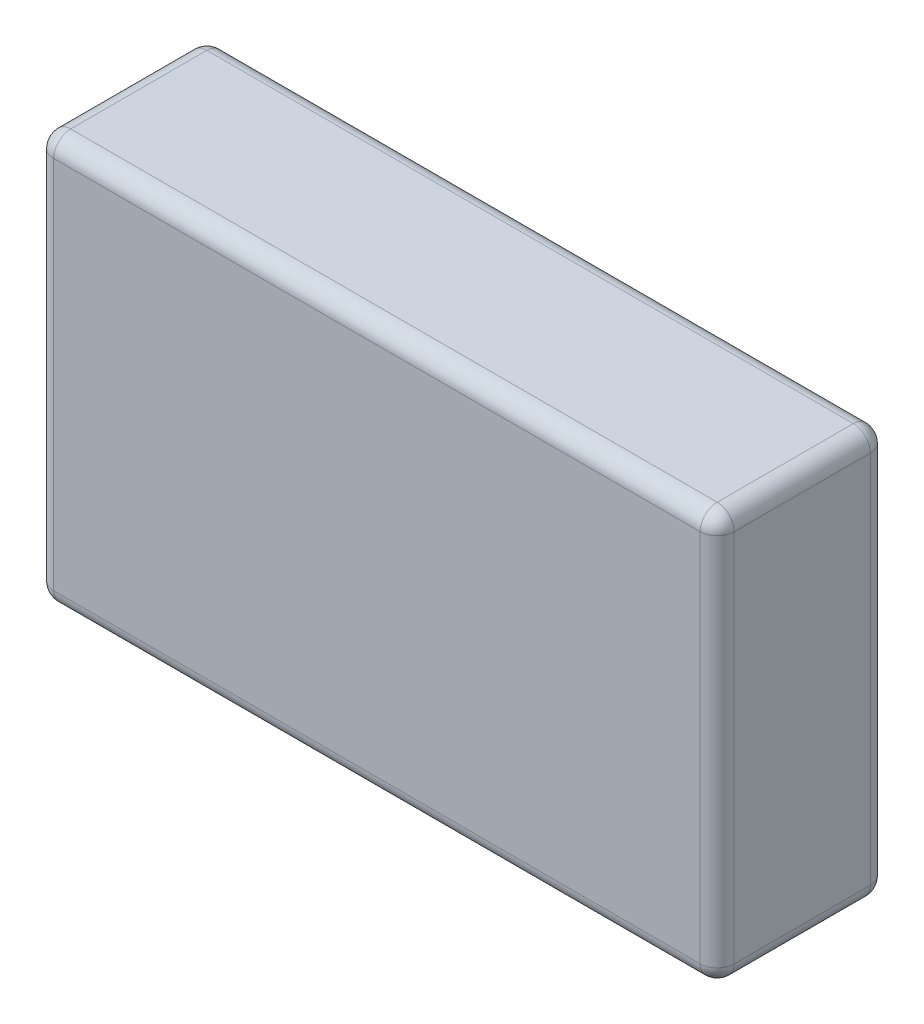
ISO-10303-21;
HEADER;
FILE_DESCRIPTION(('STEP AP214'),'2;1');
FILE_NAME('part.step','',(''),(''),'','','');
FILE_SCHEMA(('AUTOMOTIVE_DESIGN { 1 0 10303 214 1 1 1 1 }'));
ENDSEC;
DATA;
#1=APPLICATION_CONTEXT('core data for automotive mechanical design processes');
#2=APPLICATION_PROTOCOL_DEFINITION('international standard','automotive_design',2000,#1);
#3=PRODUCT_CONTEXT('',#1,'mechanical');
#4=PRODUCT('Part','Part','',(#3));
#5=PRODUCT_RELATED_PRODUCT_CATEGORY('part','',(#4));
#6=PRODUCT_DEFINITION_FORMATION('','',#4);
#7=PRODUCT_DEFINITION_CONTEXT('part definition',#1,'design');
#8=PRODUCT_DEFINITION('design','',#6,#7);
#9=PRODUCT_DEFINITION_SHAPE('','',#8);
#10=(LENGTH_UNIT() NAMED_UNIT(*) SI_UNIT(.MILLI.,.METRE.));
#11=(NAMED_UNIT(*) PLANE_ANGLE_UNIT() SI_UNIT($,.RADIAN.));
#12=(NAMED_UNIT(*) SI_UNIT($,.STERADIAN.) SOLID_ANGLE_UNIT());
#13=UNCERTAINTY_MEASURE_WITH_UNIT(LENGTH_MEASURE(1.E-05),#10,'distance_accuracy_value','');
#14=(GEOMETRIC_REPRESENTATION_CONTEXT(3) GLOBAL_UNCERTAINTY_ASSIGNED_CONTEXT((#13)) GLOBAL_UNIT_ASSIGNED_CONTEXT((#10,
#11,#12)) REPRESENTATION_CONTEXT('',''));
#15=CARTESIAN_POINT('',(0.,0.,0.));
#16=DIRECTION('',(0.,0.,1.));
#17=DIRECTION('',(1.,0.,0.));
#18=AXIS2_PLACEMENT_3D('',#15,#16,#17);
#19=CARTESIAN_POINT('',(10.,-6.,5.));
#20=DIRECTION('',(-1.,0.,0.));
#21=DIRECTION('',(0.,0.,1.));
#22=AXIS2_PLACEMENT_3D('',#19,#20,#21);
#23=PLANE('',#22);
#24=DIRECTION('',(0.,1.,0.));
#25=VECTOR('',#24,1.);
#26=CARTESIAN_POINT('',(10.,-6.,4.5));
#27=LINE('',#26,#25);
#28=CARTESIAN_POINT('',(10.,5.5,4.5));
#29=VERTEX_POINT('',#28);
#30=CARTESIAN_POINT('',(10.,-5.5,4.5));
#31=VERTEX_POINT('',#30);
#32=EDGE_CURVE('E190',#29,#31,#27,.F.);
#33=ORIENTED_EDGE('',*,*,#32,.T.);
#34=DIRECTION('',(0.,0.,-1.));
#35=VECTOR('',#34,1.);
#36=CARTESIAN_POINT('',(10.,-5.5,5.));
#37=LINE('',#36,#35);
#38=CARTESIAN_POINT('',(10.,-5.5,0.5));
#39=VERTEX_POINT('',#38);
#40=EDGE_CURVE('E195',#31,#39,#37,.T.);
#41=ORIENTED_EDGE('',*,*,#40,.T.);
#42=DIRECTION('',(0.,1.,0.));
#43=VECTOR('',#42,1.);
#44=CARTESIAN_POINT('',(10.,6.,0.5));
#45=LINE('',#44,#43);
#46=CARTESIAN_POINT('',(10.,5.5,0.5));
#47=VERTEX_POINT('',#46);
#48=EDGE_CURVE('E192',#39,#47,#45,.T.);
#49=ORIENTED_EDGE('',*,*,#48,.T.);
#50=DIRECTION('',(0.,0.,-1.));
#51=VECTOR('',#50,1.);
#52=CARTESIAN_POINT('',(10.,5.5,5.));
#53=LINE('',#52,#51);
#54=EDGE_CURVE('E188',#47,#29,#53,.F.);
#55=ORIENTED_EDGE('',*,*,#54,.T.);
#56=EDGE_LOOP('',(#33,#41,#49,#55));
#57=FACE_BOUND('',#56,.T.);
#58=ADVANCED_FACE('F36',(#57),#23,.F.);
#59=CARTESIAN_POINT('',(-10.,6.,5.));
#60=DIRECTION('',(0.,-1.,0.));
#61=DIRECTION('',(0.,0.,-1.));
#62=AXIS2_PLACEMENT_3D('',#59,#60,#61);
#63=PLANE('',#62);
#64=DIRECTION('',(-1.,0.,0.));
#65=VECTOR('',#64,1.);
#66=CARTESIAN_POINT('',(-10.,6.,4.5));
#67=LINE('',#66,#65);
#68=CARTESIAN_POINT('',(-9.5,6.,4.5));
#69=VERTEX_POINT('',#68);
#70=CARTESIAN_POINT('',(9.5,6.,4.5));
#71=VERTEX_POINT('',#70);
#72=EDGE_CURVE('E153',#69,#71,#67,.F.);
#73=ORIENTED_EDGE('',*,*,#72,.T.);
#74=DIRECTION('',(0.,0.,-1.));
#75=VECTOR('',#74,1.);
#76=CARTESIAN_POINT('',(9.5,6.,5.));
#77=LINE('',#76,#75);
#78=CARTESIAN_POINT('',(9.5,6.,0.5));
#79=VERTEX_POINT('',#78);
#80=EDGE_CURVE('E157',#71,#79,#77,.T.);
#81=ORIENTED_EDGE('',*,*,#80,.T.);
#82=DIRECTION('',(-1.,0.,0.));
#83=VECTOR('',#82,1.);
#84=CARTESIAN_POINT('',(-10.,6.,0.5));
#85=LINE('',#84,#83);
#86=CARTESIAN_POINT('',(-9.5,6.,0.5));
#87=VERTEX_POINT('',#86);
#88=EDGE_CURVE('E129',#79,#87,#85,.T.);
#89=ORIENTED_EDGE('',*,*,#88,.T.);
#90=DIRECTION('',(0.,0.,-1.));
#91=VECTOR('',#90,1.);
#92=CARTESIAN_POINT('',(-9.5,6.,5.));
#93=LINE('',#92,#91);
#94=EDGE_CURVE('E147',#87,#69,#93,.F.);
#95=ORIENTED_EDGE('',*,*,#94,.T.);
#96=EDGE_LOOP('',(#73,#81,#89,#95));
#97=FACE_BOUND('',#96,.T.);
#98=ADVANCED_FACE('F155',(#97),#63,.F.);
#99=CARTESIAN_POINT('',(-10.,-6.,5.));
#100=DIRECTION('',(1.,0.,0.));
#101=DIRECTION('',(0.,0.,-1.));
#102=AXIS2_PLACEMENT_3D('',#99,#100,#101);
#103=PLANE('',#102);
#104=DIRECTION('',(0.,-1.,0.));
#105=VECTOR('',#104,1.);
#106=CARTESIAN_POINT('',(-10.,-6.,0.5));
#107=LINE('',#106,#105);
#108=CARTESIAN_POINT('',(-10.,5.5,0.5));
#109=VERTEX_POINT('',#108);
#110=CARTESIAN_POINT('',(-10.,-5.5,0.5));
#111=VERTEX_POINT('',#110);
#112=EDGE_CURVE('E174',#109,#111,#107,.T.);
#113=ORIENTED_EDGE('',*,*,#112,.T.);
#114=DIRECTION('',(0.,0.,-1.));
#115=VECTOR('',#114,1.);
#116=CARTESIAN_POINT('',(-10.,-5.5,5.));
#117=LINE('',#116,#115);
#118=CARTESIAN_POINT('',(-10.,-5.5,4.5));
#119=VERTEX_POINT('',#118);
#120=EDGE_CURVE('E177',#111,#119,#117,.F.);
#121=ORIENTED_EDGE('',*,*,#120,.T.);
#122=DIRECTION('',(0.,-1.,0.));
#123=VECTOR('',#122,1.);
#124=CARTESIAN_POINT('',(-10.,-6.,4.5));
#125=LINE('',#124,#123);
#126=CARTESIAN_POINT('',(-10.,5.5,4.5));
#127=VERTEX_POINT('',#126);
#128=EDGE_CURVE('E172',#119,#127,#125,.F.);
#129=ORIENTED_EDGE('',*,*,#128,.T.);
#130=DIRECTION('',(0.,0.,-1.));
#131=VECTOR('',#130,1.);
#132=CARTESIAN_POINT('',(-10.,5.5,5.));
#133=LINE('',#132,#131);
#134=EDGE_CURVE('E170',#127,#109,#133,.T.);
#135=ORIENTED_EDGE('',*,*,#134,.T.);
#136=EDGE_LOOP('',(#113,#121,#129,#135));
#137=FACE_BOUND('',#136,.T.);
#138=ADVANCED_FACE('F330',(#137),#103,.F.);
#139=CARTESIAN_POINT('',(-10.,-6.,5.));
#140=DIRECTION('',(0.,1.,0.));
#141=DIRECTION('',(0.,0.,1.));
#142=AXIS2_PLACEMENT_3D('',#139,#140,#141);
#143=PLANE('',#142);
#144=DIRECTION('',(1.,0.,0.));
#145=VECTOR('',#144,1.);
#146=CARTESIAN_POINT('',(-10.,-6.,4.5));
#147=LINE('',#146,#145);
#148=CARTESIAN_POINT('',(9.5,-6.,4.5));
#149=VERTEX_POINT('',#148);
#150=CARTESIAN_POINT('',(-9.5,-6.,4.5));
#151=VERTEX_POINT('',#150);
#152=EDGE_CURVE('E181',#149,#151,#147,.F.);
#153=ORIENTED_EDGE('',*,*,#152,.T.);
#154=DIRECTION('',(0.,0.,-1.));
#155=VECTOR('',#154,1.);
#156=CARTESIAN_POINT('',(-9.5,-6.,5.));
#157=LINE('',#156,#155);
#158=CARTESIAN_POINT('',(-9.5,-6.,0.5));
#159=VERTEX_POINT('',#158);
#160=EDGE_CURVE('E186',#151,#159,#157,.T.);
#161=ORIENTED_EDGE('',*,*,#160,.T.);
#162=DIRECTION('',(1.,0.,0.));
#163=VECTOR('',#162,1.);
#164=CARTESIAN_POINT('',(10.,-6.,0.5));
#165=LINE('',#164,#163);
#166=CARTESIAN_POINT('',(9.5,-6.,0.5));
#167=VERTEX_POINT('',#166);
#168=EDGE_CURVE('E183',#159,#167,#165,.T.);
#169=ORIENTED_EDGE('',*,*,#168,.T.);
#170=DIRECTION('',(0.,0.,-1.));
#171=VECTOR('',#170,1.);
#172=CARTESIAN_POINT('',(9.5,-6.,5.));
#173=LINE('',#172,#171);
#174=EDGE_CURVE('E179',#167,#149,#173,.F.);
#175=ORIENTED_EDGE('',*,*,#174,.T.);
#176=EDGE_LOOP('',(#153,#161,#169,#175));
#177=FACE_BOUND('',#176,.T.);
#178=ADVANCED_FACE('F297',(#177),#143,.F.);
#179=CARTESIAN_POINT('',(0.,0.,5.));
#180=DIRECTION('',(0.,0.,-1.));
#181=DIRECTION('',(-1.,0.,0.));
#182=AXIS2_PLACEMENT_3D('',#179,#180,#181);
#183=PLANE('',#182);
#184=DIRECTION('',(0.,-1.,0.));
#185=VECTOR('',#184,1.);
#186=CARTESIAN_POINT('',(-9.5,0.,5.));
#187=LINE('',#186,#185);
#188=CARTESIAN_POINT('',(-9.5,5.5,5.));
#189=VERTEX_POINT('',#188);
#190=CARTESIAN_POINT('',(-9.5,-5.5,5.));
#191=VERTEX_POINT('',#190);
#192=EDGE_CURVE('E45',#189,#191,#187,.T.);
#193=ORIENTED_EDGE('',*,*,#192,.T.);
#194=DIRECTION('',(1.,0.,0.));
#195=VECTOR('',#194,1.);
#196=CARTESIAN_POINT('',(0.,-5.5,5.));
#197=LINE('',#196,#195);
#198=CARTESIAN_POINT('',(9.5,-5.5,5.));
#199=VERTEX_POINT('',#198);
#200=EDGE_CURVE('E11',#191,#199,#197,.T.);
#201=ORIENTED_EDGE('',*,*,#200,.T.);
#202=DIRECTION('',(0.,1.,0.));
#203=VECTOR('',#202,1.);
#204=CARTESIAN_POINT('',(9.5,0.,5.));
#205=LINE('',#204,#203);
#206=CARTESIAN_POINT('',(9.5,5.5,5.));
#207=VERTEX_POINT('',#206);
#208=EDGE_CURVE('E197',#199,#207,#205,.T.);
#209=ORIENTED_EDGE('',*,*,#208,.T.);
#210=DIRECTION('',(-1.,0.,0.));
#211=VECTOR('',#210,1.);
#212=CARTESIAN_POINT('',(0.,5.5,5.));
#213=LINE('',#212,#211);
#214=EDGE_CURVE('E56',#207,#189,#213,.T.);
#215=ORIENTED_EDGE('',*,*,#214,.T.);
#216=EDGE_LOOP('',(#193,#201,#209,#215));
#217=FACE_BOUND('',#216,.T.);
#218=ADVANCED_FACE('F277',(#217),#183,.F.);
#219=CARTESIAN_POINT('',(0.,0.,0.));
#220=DIRECTION('',(0.,0.,-1.));
#221=DIRECTION('',(-1.,0.,0.));
#222=AXIS2_PLACEMENT_3D('',#219,#220,#221);
#223=PLANE('',#222);
#224=DIRECTION('',(0.,-1.,0.));
#225=VECTOR('',#224,1.);
#226=CARTESIAN_POINT('',(-9.5,6.,0.));
#227=LINE('',#226,#225);
#228=CARTESIAN_POINT('',(-9.5,-5.5,0.));
#229=VERTEX_POINT('',#228);
#230=CARTESIAN_POINT('',(-9.5,5.5,0.));
#231=VERTEX_POINT('',#230);
#232=EDGE_CURVE('E167',#229,#231,#227,.F.);
#233=ORIENTED_EDGE('',*,*,#232,.T.);
#234=DIRECTION('',(-1.,0.,0.));
#235=VECTOR('',#234,1.);
#236=CARTESIAN_POINT('',(10.,5.5,0.));
#237=LINE('',#236,#235);
#238=CARTESIAN_POINT('',(9.5,5.5,0.));
#239=VERTEX_POINT('',#238);
#240=EDGE_CURVE('E131',#231,#239,#237,.F.);
#241=ORIENTED_EDGE('',*,*,#240,.T.);
#242=DIRECTION('',(0.,1.,0.));
#243=VECTOR('',#242,1.);
#244=CARTESIAN_POINT('',(9.5,-6.,0.));
#245=LINE('',#244,#243);
#246=CARTESIAN_POINT('',(9.5,-5.5,0.));
#247=VERTEX_POINT('',#246);
#248=EDGE_CURVE('E160',#239,#247,#245,.F.);
#249=ORIENTED_EDGE('',*,*,#248,.T.);
#250=DIRECTION('',(1.,0.,0.));
#251=VECTOR('',#250,1.);
#252=CARTESIAN_POINT('',(-10.,-5.5,0.));
#253=LINE('',#252,#251);
#254=EDGE_CURVE('E165',#247,#229,#253,.F.);
#255=ORIENTED_EDGE('',*,*,#254,.T.);
#256=EDGE_LOOP('',(#233,#241,#249,#255));
#257=FACE_BOUND('',#256,.T.);
#258=ADVANCED_FACE('F358',(#257),#223,.T.);
#259=CARTESIAN_POINT('',(0.,-5.5,4.5));
#260=DIRECTION('',(1.,0.,0.));
#261=DIRECTION('',(0.,0.,-1.));
#262=AXIS2_PLACEMENT_3D('',#259,#260,#261);
#263=CYLINDRICAL_SURFACE('',#262,0.5);
#264=CARTESIAN_POINT('',(9.5,-5.5,4.5));
#265=DIRECTION('',(1.,0.,0.));
#266=DIRECTION('',(0.,0.,-1.));
#267=AXIS2_PLACEMENT_3D('',#264,#265,#266);
#268=CIRCLE('',#267,0.5);
#269=EDGE_CURVE('E40',#199,#149,#268,.T.);
#270=ORIENTED_EDGE('',*,*,#269,.F.);
#271=ORIENTED_EDGE('',*,*,#200,.F.);
#272=CARTESIAN_POINT('',(-9.5,-5.5,4.5));
#273=DIRECTION('',(-1.,0.,0.));
#274=DIRECTION('',(0.,0.,1.));
#275=AXIS2_PLACEMENT_3D('',#272,#273,#274);
#276=CIRCLE('',#275,0.5);
#277=EDGE_CURVE('E250',#151,#191,#276,.T.);
#278=ORIENTED_EDGE('',*,*,#277,.F.);
#279=ORIENTED_EDGE('',*,*,#152,.F.);
#280=EDGE_LOOP('',(#270,#271,#278,#279));
#281=FACE_BOUND('',#280,.T.);
#282=ADVANCED_FACE('F38',(#281),#263,.T.);
#283=CARTESIAN_POINT('',(9.5,-5.5,4.5));
#284=DIRECTION('',(0.,0.,1.));
#285=DIRECTION('',(1.,0.,0.));
#286=AXIS2_PLACEMENT_3D('',#283,#284,#285);
#287=SPHERICAL_SURFACE('',#286,0.5);
#288=CARTESIAN_POINT('',(9.5,-5.5,4.5));
#289=DIRECTION('',(0.,-1.,0.));
#290=DIRECTION('',(0.,0.,-1.));
#291=AXIS2_PLACEMENT_3D('',#288,#289,#290);
#292=CIRCLE('',#291,0.5);
#293=EDGE_CURVE('E245',#199,#31,#292,.F.);
#294=ORIENTED_EDGE('',*,*,#293,.F.);
#295=ORIENTED_EDGE('',*,*,#269,.T.);
#296=CARTESIAN_POINT('',(9.5,-5.5,4.5));
#297=DIRECTION('',(0.,0.,1.));
#298=DIRECTION('',(1.,0.,0.));
#299=AXIS2_PLACEMENT_3D('',#296,#297,#298);
#300=CIRCLE('',#299,0.5);
#301=EDGE_CURVE('E248',#31,#149,#300,.F.);
#302=ORIENTED_EDGE('',*,*,#301,.F.);
#303=EDGE_LOOP('',(#294,#295,#302));
#304=FACE_BOUND('',#303,.T.);
#305=ADVANCED_FACE('F261',(#304),#287,.T.);
#306=CARTESIAN_POINT('',(-9.5,-5.5,4.5));
#307=DIRECTION('',(0.,0.,1.));
#308=DIRECTION('',(1.,0.,0.));
#309=AXIS2_PLACEMENT_3D('',#306,#307,#308);
#310=SPHERICAL_SURFACE('',#309,0.5);
#311=CARTESIAN_POINT('',(-9.5,-5.5,4.5));
#312=DIRECTION('',(0.,0.,1.));
#313=DIRECTION('',(1.,0.,0.));
#314=AXIS2_PLACEMENT_3D('',#311,#312,#313);
#315=CIRCLE('',#314,0.5);
#316=EDGE_CURVE('E239',#151,#119,#315,.F.);
#317=ORIENTED_EDGE('',*,*,#316,.F.);
#318=ORIENTED_EDGE('',*,*,#277,.T.);
#319=CARTESIAN_POINT('',(-9.5,-5.5,4.5));
#320=DIRECTION('',(0.,-1.,0.));
#321=DIRECTION('',(0.,0.,-1.));
#322=AXIS2_PLACEMENT_3D('',#319,#320,#321);
#323=CIRCLE('',#322,0.5);
#324=EDGE_CURVE('E242',#119,#191,#323,.F.);
#325=ORIENTED_EDGE('',*,*,#324,.F.);
#326=EDGE_LOOP('',(#317,#318,#325));
#327=FACE_BOUND('',#326,.T.);
#328=ADVANCED_FACE('F289',(#327),#310,.T.);
#329=CARTESIAN_POINT('',(9.5,-5.5,5.));
#330=DIRECTION('',(0.,0.,-1.));
#331=DIRECTION('',(-1.,0.,0.));
#332=AXIS2_PLACEMENT_3D('',#329,#330,#331);
#333=CYLINDRICAL_SURFACE('',#332,0.5);
#334=ORIENTED_EDGE('',*,*,#301,.T.);
#335=ORIENTED_EDGE('',*,*,#174,.F.);
#336=CARTESIAN_POINT('',(9.5,-5.5,0.5));
#337=DIRECTION('',(0.,0.,-1.));
#338=DIRECTION('',(-1.,0.,0.));
#339=AXIS2_PLACEMENT_3D('',#336,#337,#338);
#340=CIRCLE('',#339,0.5);
#341=EDGE_CURVE('E234',#39,#167,#340,.T.);
#342=ORIENTED_EDGE('',*,*,#341,.F.);
#343=ORIENTED_EDGE('',*,*,#40,.F.);
#344=EDGE_LOOP('',(#334,#335,#342,#343));
#345=FACE_BOUND('',#344,.T.);
#346=ADVANCED_FACE('F267',(#345),#333,.T.);
#347=CARTESIAN_POINT('',(9.5,0.,4.5));
#348=DIRECTION('',(0.,1.,0.));
#349=DIRECTION('',(0.,0.,1.));
#350=AXIS2_PLACEMENT_3D('',#347,#348,#349);
#351=CYLINDRICAL_SURFACE('',#350,0.5);
#352=ORIENTED_EDGE('',*,*,#293,.T.);
#353=ORIENTED_EDGE('',*,*,#32,.F.);
#354=CARTESIAN_POINT('',(9.5,5.5,4.5));
#355=DIRECTION('',(0.,1.,0.));
#356=DIRECTION('',(0.,0.,1.));
#357=AXIS2_PLACEMENT_3D('',#354,#355,#356);
#358=CIRCLE('',#357,0.5);
#359=EDGE_CURVE('E231',#207,#29,#358,.T.);
#360=ORIENTED_EDGE('',*,*,#359,.F.);
#361=ORIENTED_EDGE('',*,*,#208,.F.);
#362=EDGE_LOOP('',(#352,#353,#360,#361));
#363=FACE_BOUND('',#362,.T.);
#364=ADVANCED_FACE('F276',(#363),#351,.T.);
#365=CARTESIAN_POINT('',(0.,5.5,4.5));
#366=DIRECTION('',(-1.,0.,0.));
#367=DIRECTION('',(0.,0.,1.));
#368=AXIS2_PLACEMENT_3D('',#365,#366,#367);
#369=CYLINDRICAL_SURFACE('',#368,0.5);
#370=CARTESIAN_POINT('',(-9.5,5.5,4.5));
#371=DIRECTION('',(-1.,0.,0.));
#372=DIRECTION('',(0.,0.,1.));
#373=AXIS2_PLACEMENT_3D('',#370,#371,#372);
#374=CIRCLE('',#373,0.5);
#375=EDGE_CURVE('E225',#189,#69,#374,.T.);
#376=ORIENTED_EDGE('',*,*,#375,.F.);
#377=ORIENTED_EDGE('',*,*,#214,.F.);
#378=CARTESIAN_POINT('',(9.5,5.5,4.5));
#379=DIRECTION('',(1.,0.,0.));
#380=DIRECTION('',(0.,0.,-1.));
#381=AXIS2_PLACEMENT_3D('',#378,#379,#380);
#382=CIRCLE('',#381,0.5);
#383=EDGE_CURVE('E228',#71,#207,#382,.T.);
#384=ORIENTED_EDGE('',*,*,#383,.F.);
#385=ORIENTED_EDGE('',*,*,#72,.F.);
#386=EDGE_LOOP('',(#376,#377,#384,#385));
#387=FACE_BOUND('',#386,.T.);
#388=ADVANCED_FACE('F281',(#387),#369,.T.);
#389=CARTESIAN_POINT('',(-9.5,0.,4.5));
#390=DIRECTION('',(0.,-1.,0.));
#391=DIRECTION('',(0.,0.,-1.));
#392=AXIS2_PLACEMENT_3D('',#389,#390,#391);
#393=CYLINDRICAL_SURFACE('',#392,0.5);
#394=ORIENTED_EDGE('',*,*,#324,.T.);
#395=ORIENTED_EDGE('',*,*,#192,.F.);
#396=CARTESIAN_POINT('',(-9.5,5.5,4.5));
#397=DIRECTION('',(0.,1.,0.));
#398=DIRECTION('',(0.,0.,1.));
#399=AXIS2_PLACEMENT_3D('',#396,#397,#398);
#400=CIRCLE('',#399,0.5);
#401=EDGE_CURVE('E222',#127,#189,#400,.T.);
#402=ORIENTED_EDGE('',*,*,#401,.F.);
#403=ORIENTED_EDGE('',*,*,#128,.F.);
#404=EDGE_LOOP('',(#394,#395,#402,#403));
#405=FACE_BOUND('',#404,.T.);
#406=ADVANCED_FACE('F288',(#405),#393,.T.);
#407=CARTESIAN_POINT('',(-9.5,-5.5,5.));
#408=DIRECTION('',(0.,0.,-1.));
#409=DIRECTION('',(-1.,0.,0.));
#410=AXIS2_PLACEMENT_3D('',#407,#408,#409);
#411=CYLINDRICAL_SURFACE('',#410,0.5);
#412=ORIENTED_EDGE('',*,*,#316,.T.);
#413=ORIENTED_EDGE('',*,*,#120,.F.);
#414=CARTESIAN_POINT('',(-9.5,-5.5,0.5));
#415=DIRECTION('',(0.,0.,-1.));
#416=DIRECTION('',(-1.,0.,0.));
#417=AXIS2_PLACEMENT_3D('',#414,#415,#416);
#418=CIRCLE('',#417,0.5);
#419=EDGE_CURVE('E219',#159,#111,#418,.T.);
#420=ORIENTED_EDGE('',*,*,#419,.F.);
#421=ORIENTED_EDGE('',*,*,#160,.F.);
#422=EDGE_LOOP('',(#412,#413,#420,#421));
#423=FACE_BOUND('',#422,.T.);
#424=ADVANCED_FACE('F294',(#423),#411,.T.);
#425=CARTESIAN_POINT('',(-10.,-5.5,0.5));
#426=DIRECTION('',(-1.,0.,0.));
#427=DIRECTION('',(0.,0.,1.));
#428=AXIS2_PLACEMENT_3D('',#425,#426,#427);
#429=CYLINDRICAL_SURFACE('',#428,0.5);
#430=CARTESIAN_POINT('',(9.5,-5.5,0.5));
#431=DIRECTION('',(1.,0.,0.));
#432=DIRECTION('',(0.,0.,-1.));
#433=AXIS2_PLACEMENT_3D('',#430,#431,#432);
#434=CIRCLE('',#433,0.5);
#435=EDGE_CURVE('E236',#167,#247,#434,.T.);
#436=ORIENTED_EDGE('',*,*,#435,.F.);
#437=ORIENTED_EDGE('',*,*,#168,.F.);
#438=CARTESIAN_POINT('',(-9.5,-5.5,0.5));
#439=DIRECTION('',(-1.,0.,0.));
#440=DIRECTION('',(0.,0.,1.));
#441=AXIS2_PLACEMENT_3D('',#438,#439,#440);
#442=CIRCLE('',#441,0.5);
#443=EDGE_CURVE('E216',#229,#159,#442,.T.);
#444=ORIENTED_EDGE('',*,*,#443,.F.);
#445=ORIENTED_EDGE('',*,*,#254,.F.);
#446=EDGE_LOOP('',(#436,#437,#444,#445));
#447=FACE_BOUND('',#446,.T.);
#448=ADVANCED_FACE('F301',(#447),#429,.T.);
#449=CARTESIAN_POINT('',(9.5,-5.5,0.5));
#450=DIRECTION('',(0.,0.,1.));
#451=DIRECTION('',(1.,0.,0.));
#452=AXIS2_PLACEMENT_3D('',#449,#450,#451);
#453=SPHERICAL_SURFACE('',#452,0.5);
#454=ORIENTED_EDGE('',*,*,#341,.T.);
#455=ORIENTED_EDGE('',*,*,#435,.T.);
#456=CARTESIAN_POINT('',(9.5,-5.5,0.5));
#457=DIRECTION('',(0.,-1.,0.));
#458=DIRECTION('',(0.,0.,-1.));
#459=AXIS2_PLACEMENT_3D('',#456,#457,#458);
#460=CIRCLE('',#459,0.5);
#461=EDGE_CURVE('E213',#39,#247,#460,.F.);
#462=ORIENTED_EDGE('',*,*,#461,.F.);
#463=EDGE_LOOP('',(#454,#455,#462));
#464=FACE_BOUND('',#463,.T.);
#465=ADVANCED_FACE('F305',(#464),#453,.T.);
#466=CARTESIAN_POINT('',(9.5,5.5,4.5));
#467=DIRECTION('',(0.,0.,1.));
#468=DIRECTION('',(1.,0.,0.));
#469=AXIS2_PLACEMENT_3D('',#466,#467,#468);
#470=SPHERICAL_SURFACE('',#469,0.5);
#471=ORIENTED_EDGE('',*,*,#383,.T.);
#472=ORIENTED_EDGE('',*,*,#359,.T.);
#473=CARTESIAN_POINT('',(9.5,5.5,4.5));
#474=DIRECTION('',(0.,0.,1.));
#475=DIRECTION('',(1.,0.,0.));
#476=AXIS2_PLACEMENT_3D('',#473,#474,#475);
#477=CIRCLE('',#476,0.5);
#478=EDGE_CURVE('E210',#71,#29,#477,.F.);
#479=ORIENTED_EDGE('',*,*,#478,.F.);
#480=EDGE_LOOP('',(#471,#472,#479));
#481=FACE_BOUND('',#480,.T.);
#482=ADVANCED_FACE('F315',(#481),#470,.T.);
#483=CARTESIAN_POINT('',(-9.5,5.5,4.5));
#484=DIRECTION('',(0.,0.,1.));
#485=DIRECTION('',(1.,0.,0.));
#486=AXIS2_PLACEMENT_3D('',#483,#484,#485);
#487=SPHERICAL_SURFACE('',#486,0.5);
#488=ORIENTED_EDGE('',*,*,#401,.T.);
#489=ORIENTED_EDGE('',*,*,#375,.T.);
#490=CARTESIAN_POINT('',(-9.5,5.5,4.5));
#491=DIRECTION('',(0.,0.,1.));
#492=DIRECTION('',(1.,0.,0.));
#493=AXIS2_PLACEMENT_3D('',#490,#491,#492);
#494=CIRCLE('',#493,0.5);
#495=EDGE_CURVE('E150',#127,#69,#494,.F.);
#496=ORIENTED_EDGE('',*,*,#495,.F.);
#497=EDGE_LOOP('',(#488,#489,#496));
#498=FACE_BOUND('',#497,.T.);
#499=ADVANCED_FACE('F285',(#498),#487,.T.);
#500=CARTESIAN_POINT('',(-9.5,-5.5,0.5));
#501=DIRECTION('',(0.,0.,1.));
#502=DIRECTION('',(1.,0.,0.));
#503=AXIS2_PLACEMENT_3D('',#500,#501,#502);
#504=SPHERICAL_SURFACE('',#503,0.5);
#505=ORIENTED_EDGE('',*,*,#443,.T.);
#506=ORIENTED_EDGE('',*,*,#419,.T.);
#507=CARTESIAN_POINT('',(-9.5,-5.5,0.5));
#508=DIRECTION('',(0.,-1.,0.));
#509=DIRECTION('',(0.,0.,-1.));
#510=AXIS2_PLACEMENT_3D('',#507,#508,#509);
#511=CIRCLE('',#510,0.5);
#512=EDGE_CURVE('E207',#229,#111,#511,.F.);
#513=ORIENTED_EDGE('',*,*,#512,.F.);
#514=EDGE_LOOP('',(#505,#506,#513));
#515=FACE_BOUND('',#514,.T.);
#516=ADVANCED_FACE('F322',(#515),#504,.T.);
#517=CARTESIAN_POINT('',(9.5,-6.,0.5));
#518=DIRECTION('',(0.,-1.,0.));
#519=DIRECTION('',(0.,0.,-1.));
#520=AXIS2_PLACEMENT_3D('',#517,#518,#519);
#521=CYLINDRICAL_SURFACE('',#520,0.5);
#522=ORIENTED_EDGE('',*,*,#461,.T.);
#523=ORIENTED_EDGE('',*,*,#248,.F.);
#524=CARTESIAN_POINT('',(9.5,5.5,0.5));
#525=DIRECTION('',(0.,1.,0.));
#526=DIRECTION('',(0.,0.,1.));
#527=AXIS2_PLACEMENT_3D('',#524,#525,#526);
#528=CIRCLE('',#527,0.5);
#529=EDGE_CURVE('E204',#47,#239,#528,.T.);
#530=ORIENTED_EDGE('',*,*,#529,.F.);
#531=ORIENTED_EDGE('',*,*,#48,.F.);
#532=EDGE_LOOP('',(#522,#523,#530,#531));
#533=FACE_BOUND('',#532,.T.);
#534=ADVANCED_FACE('F308',(#533),#521,.T.);
#535=CARTESIAN_POINT('',(9.5,5.5,5.));
#536=DIRECTION('',(0.,0.,-1.));
#537=DIRECTION('',(-1.,0.,0.));
#538=AXIS2_PLACEMENT_3D('',#535,#536,#537);
#539=CYLINDRICAL_SURFACE('',#538,0.5);
#540=ORIENTED_EDGE('',*,*,#478,.T.);
#541=ORIENTED_EDGE('',*,*,#54,.F.);
#542=CARTESIAN_POINT('',(9.5,5.5,0.5));
#543=DIRECTION('',(0.,0.,-1.));
#544=DIRECTION('',(-1.,0.,0.));
#545=AXIS2_PLACEMENT_3D('',#542,#543,#544);
#546=CIRCLE('',#545,0.5);
#547=EDGE_CURVE('E144',#79,#47,#546,.T.);
#548=ORIENTED_EDGE('',*,*,#547,.F.);
#549=ORIENTED_EDGE('',*,*,#80,.F.);
#550=EDGE_LOOP('',(#540,#541,#548,#549));
#551=FACE_BOUND('',#550,.T.);
#552=ADVANCED_FACE('F313',(#551),#539,.T.);
#553=CARTESIAN_POINT('',(-9.5,5.5,5.));
#554=DIRECTION('',(0.,0.,-1.));
#555=DIRECTION('',(-1.,0.,0.));
#556=AXIS2_PLACEMENT_3D('',#553,#554,#555);
#557=CYLINDRICAL_SURFACE('',#556,0.5);
#558=ORIENTED_EDGE('',*,*,#495,.T.);
#559=ORIENTED_EDGE('',*,*,#94,.F.);
#560=CARTESIAN_POINT('',(-9.5,5.5,0.5));
#561=DIRECTION('',(0.,0.,-1.));
#562=DIRECTION('',(-1.,0.,0.));
#563=AXIS2_PLACEMENT_3D('',#560,#561,#562);
#564=CIRCLE('',#563,0.5);
#565=EDGE_CURVE('E137',#109,#87,#564,.T.);
#566=ORIENTED_EDGE('',*,*,#565,.F.);
#567=ORIENTED_EDGE('',*,*,#134,.F.);
#568=EDGE_LOOP('',(#558,#559,#566,#567));
#569=FACE_BOUND('',#568,.T.);
#570=ADVANCED_FACE('F148',(#569),#557,.T.);
#571=CARTESIAN_POINT('',(-9.5,-6.,0.5));
#572=DIRECTION('',(0.,1.,0.));
#573=DIRECTION('',(0.,0.,1.));
#574=AXIS2_PLACEMENT_3D('',#571,#572,#573);
#575=CYLINDRICAL_SURFACE('',#574,0.5);
#576=ORIENTED_EDGE('',*,*,#512,.T.);
#577=ORIENTED_EDGE('',*,*,#112,.F.);
#578=CARTESIAN_POINT('',(-9.5,5.5,0.5));
#579=DIRECTION('',(0.,1.,0.));
#580=DIRECTION('',(-1.,0.,0.));
#581=AXIS2_PLACEMENT_3D('',#578,#579,#580);
#582=CIRCLE('',#581,0.5);
#583=EDGE_CURVE('E141',#231,#109,#582,.T.);
#584=ORIENTED_EDGE('',*,*,#583,.F.);
#585=ORIENTED_EDGE('',*,*,#232,.F.);
#586=EDGE_LOOP('',(#576,#577,#584,#585));
#587=FACE_BOUND('',#586,.T.);
#588=ADVANCED_FACE('F341',(#587),#575,.T.);
#589=CARTESIAN_POINT('',(9.5,5.5,0.5));
#590=DIRECTION('',(0.,0.,1.));
#591=DIRECTION('',(1.,0.,0.));
#592=AXIS2_PLACEMENT_3D('',#589,#590,#591);
#593=SPHERICAL_SURFACE('',#592,0.5);
#594=ORIENTED_EDGE('',*,*,#547,.T.);
#595=ORIENTED_EDGE('',*,*,#529,.T.);
#596=CARTESIAN_POINT('',(9.5,5.5,0.5));
#597=DIRECTION('',(1.,0.,0.));
#598=DIRECTION('',(0.,0.,-1.));
#599=AXIS2_PLACEMENT_3D('',#596,#597,#598);
#600=CIRCLE('',#599,0.5);
#601=EDGE_CURVE('E134',#79,#239,#600,.F.);
#602=ORIENTED_EDGE('',*,*,#601,.F.);
#603=EDGE_LOOP('',(#594,#595,#602));
#604=FACE_BOUND('',#603,.T.);
#605=ADVANCED_FACE('F338',(#604),#593,.T.);
#606=CARTESIAN_POINT('',(-9.5,5.5,0.5));
#607=DIRECTION('',(0.,0.,1.));
#608=DIRECTION('',(1.,0.,0.));
#609=AXIS2_PLACEMENT_3D('',#606,#607,#608);
#610=SPHERICAL_SURFACE('',#609,0.5);
#611=ORIENTED_EDGE('',*,*,#583,.T.);
#612=ORIENTED_EDGE('',*,*,#565,.T.);
#613=CARTESIAN_POINT('',(-9.5,5.5,0.5));
#614=DIRECTION('',(-1.,0.,0.));
#615=DIRECTION('',(0.,0.,1.));
#616=AXIS2_PLACEMENT_3D('',#613,#614,#615);
#617=CIRCLE('',#616,0.5);
#618=EDGE_CURVE('E125',#231,#87,#617,.F.);
#619=ORIENTED_EDGE('',*,*,#618,.F.);
#620=EDGE_LOOP('',(#611,#612,#619));
#621=FACE_BOUND('',#620,.T.);
#622=ADVANCED_FACE('F139',(#621),#610,.T.);
#623=CARTESIAN_POINT('',(-10.,5.5,0.5));
#624=DIRECTION('',(1.,0.,0.));
#625=DIRECTION('',(0.,0.,-1.));
#626=AXIS2_PLACEMENT_3D('',#623,#624,#625);
#627=CYLINDRICAL_SURFACE('',#626,0.5);
#628=ORIENTED_EDGE('',*,*,#601,.T.);
#629=ORIENTED_EDGE('',*,*,#240,.F.);
#630=ORIENTED_EDGE('',*,*,#618,.T.);
#631=ORIENTED_EDGE('',*,*,#88,.F.);
#632=EDGE_LOOP('',(#628,#629,#630,#631));
#633=FACE_BOUND('',#632,.T.);
#634=ADVANCED_FACE('F127',(#633),#627,.T.);
#635=CLOSED_SHELL('',(#58,#98,#138,#178,#218,#258,#282,#305,#328,#346,#364,#388,#406,#424,#448,
#465,#482,#499,#516,#534,#552,#570,#588,#605,#622,#634));
#636=MANIFOLD_SOLID_BREP('B2',#635);
#637=ADVANCED_BREP_SHAPE_REPRESENTATION('',(#18,#636),#14);
#638=SHAPE_DEFINITION_REPRESENTATION(#9,#637);
ENDSEC;
END-ISO-10303-21;
